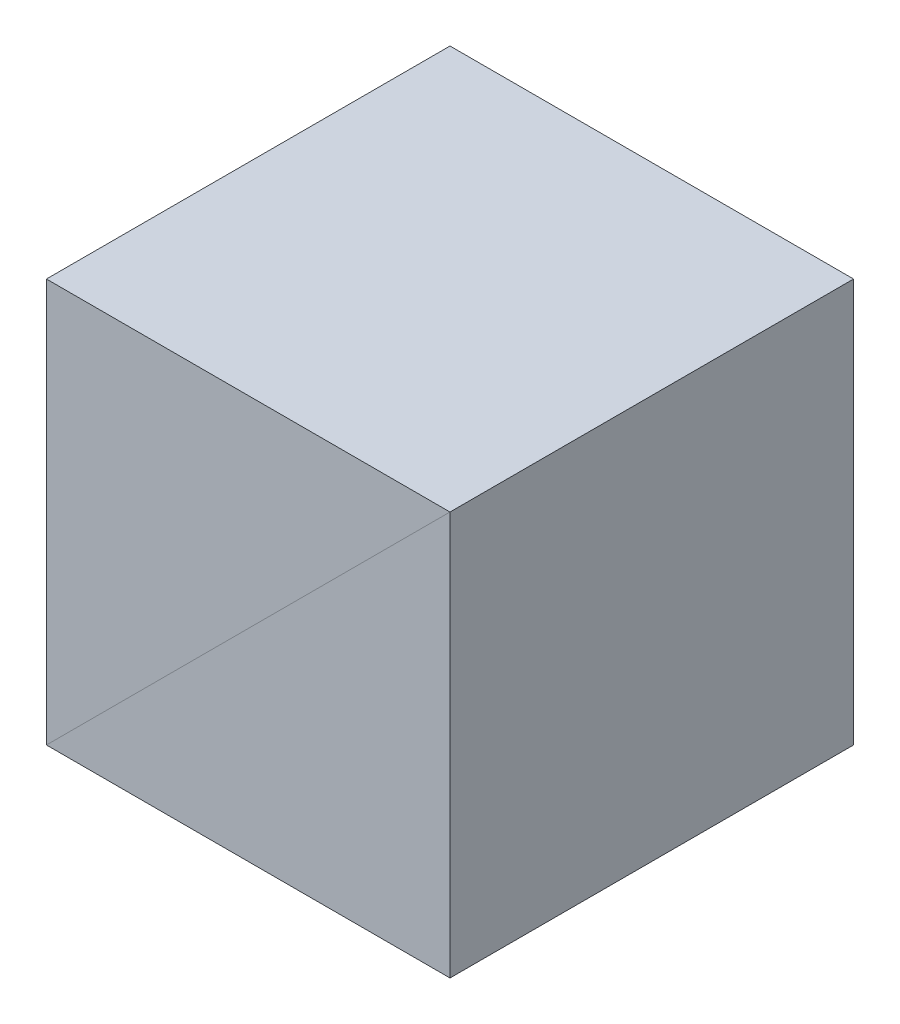
ISO-10303-21;
HEADER;
FILE_DESCRIPTION(('STEP AP214'),'2;1');
FILE_NAME('part.step','',(''),(''),'','','');
FILE_SCHEMA(('AUTOMOTIVE_DESIGN { 1 0 10303 214 1 1 1 1 }'));
ENDSEC;
DATA;
#1=APPLICATION_CONTEXT('core data for automotive mechanical design processes');
#2=APPLICATION_PROTOCOL_DEFINITION('international standard','automotive_design',2000,#1);
#3=PRODUCT_CONTEXT('',#1,'mechanical');
#4=PRODUCT('Part','Part','',(#3));
#5=PRODUCT_RELATED_PRODUCT_CATEGORY('part','',(#4));
#6=PRODUCT_DEFINITION_FORMATION('','',#4);
#7=PRODUCT_DEFINITION_CONTEXT('part definition',#1,'design');
#8=PRODUCT_DEFINITION('design','',#6,#7);
#9=PRODUCT_DEFINITION_SHAPE('','',#8);
#10=(LENGTH_UNIT() NAMED_UNIT(*) SI_UNIT(.MILLI.,.METRE.));
#11=(NAMED_UNIT(*) PLANE_ANGLE_UNIT() SI_UNIT($,.RADIAN.));
#12=(NAMED_UNIT(*) SI_UNIT($,.STERADIAN.) SOLID_ANGLE_UNIT());
#13=UNCERTAINTY_MEASURE_WITH_UNIT(LENGTH_MEASURE(1.E-05),#10,'distance_accuracy_value','');
#14=(GEOMETRIC_REPRESENTATION_CONTEXT(3) GLOBAL_UNCERTAINTY_ASSIGNED_CONTEXT((#13)) GLOBAL_UNIT_ASSIGNED_CONTEXT((#10,
#11,#12)) REPRESENTATION_CONTEXT('',''));
#15=CARTESIAN_POINT('',(0.,0.,0.));
#16=DIRECTION('',(0.,0.,1.));
#17=DIRECTION('',(1.,0.,0.));
#18=AXIS2_PLACEMENT_3D('',#15,#16,#17);
#19=CARTESIAN_POINT('',(10.,10.,10.));
#20=DIRECTION('',(-0.707106781186548,0.707106781186548,0.));
#21=DIRECTION('',(0.,0.,1.));
#22=AXIS2_PLACEMENT_3D('',#19,#20,#21);
#23=PLANE('',#22);
#24=DIRECTION('',(0.707106781186548,0.707106781186548,0.));
#25=VECTOR('',#24,1.);
#26=CARTESIAN_POINT('',(10.,10.,0.));
#27=LINE('',#26,#25);
#28=CARTESIAN_POINT('',(0.,0.,0.));
#29=VERTEX_POINT('',#28);
#30=CARTESIAN_POINT('',(10.,10.,0.));
#31=VERTEX_POINT('',#30);
#32=EDGE_CURVE('P0_E11',#29,#31,#27,.T.);
#33=ORIENTED_EDGE('',*,*,#32,.T.);
#34=DIRECTION('',(0.,0.,-1.));
#35=VECTOR('',#34,1.);
#36=CARTESIAN_POINT('',(10.,10.,10.));
#37=LINE('',#36,#35);
#38=CARTESIAN_POINT('',(10.,10.,10.));
#39=VERTEX_POINT('',#38);
#40=EDGE_CURVE('P0_E40',#39,#31,#37,.T.);
#41=ORIENTED_EDGE('',*,*,#40,.F.);
#42=DIRECTION('',(0.707106781186548,0.707106781186548,0.));
#43=VECTOR('',#42,1.);
#44=CARTESIAN_POINT('',(10.,10.,10.));
#45=LINE('',#44,#43);
#46=CARTESIAN_POINT('',(0.,0.,10.));
#47=VERTEX_POINT('',#46);
#48=EDGE_CURVE('P0_E62',#47,#39,#45,.T.);
#49=ORIENTED_EDGE('',*,*,#48,.F.);
#50=DIRECTION('',(0.,0.,-1.));
#51=VECTOR('',#50,1.);
#52=CARTESIAN_POINT('',(0.,0.,10.));
#53=LINE('',#52,#51);
#54=EDGE_CURVE('P0_E26',#47,#29,#53,.T.);
#55=ORIENTED_EDGE('',*,*,#54,.T.);
#56=EDGE_LOOP('',(#33,#41,#49,#55));
#57=FACE_BOUND('',#56,.T.);
#58=ADVANCED_FACE('P0_F16',(#57),#23,.F.);
#59=CARTESIAN_POINT('',(0.,10.,10.));
#60=DIRECTION('',(0.,-1.,0.));
#61=DIRECTION('',(0.,0.,-1.));
#62=AXIS2_PLACEMENT_3D('',#59,#60,#61);
#63=PLANE('',#62);
#64=DIRECTION('',(-1.,0.,0.));
#65=VECTOR('',#64,1.);
#66=CARTESIAN_POINT('',(0.,10.,0.));
#67=LINE('',#66,#65);
#68=CARTESIAN_POINT('',(0.,10.,0.));
#69=VERTEX_POINT('',#68);
#70=EDGE_CURVE('P0_E19',#31,#69,#67,.T.);
#71=ORIENTED_EDGE('',*,*,#70,.T.);
#72=DIRECTION('',(0.,0.,-1.));
#73=VECTOR('',#72,1.);
#74=CARTESIAN_POINT('',(0.,10.,10.));
#75=LINE('',#74,#73);
#76=CARTESIAN_POINT('',(0.,10.,10.));
#77=VERTEX_POINT('',#76);
#78=EDGE_CURVE('P0_E67',#77,#69,#75,.T.);
#79=ORIENTED_EDGE('',*,*,#78,.F.);
#80=DIRECTION('',(-1.,0.,0.));
#81=VECTOR('',#80,1.);
#82=CARTESIAN_POINT('',(0.,10.,10.));
#83=LINE('',#82,#81);
#84=EDGE_CURVE('P0_E68',#39,#77,#83,.T.);
#85=ORIENTED_EDGE('',*,*,#84,.F.);
#86=ORIENTED_EDGE('',*,*,#40,.T.);
#87=EDGE_LOOP('',(#71,#79,#85,#86));
#88=FACE_BOUND('',#87,.T.);
#89=ADVANCED_FACE('P0_F100',(#88),#63,.F.);
#90=CARTESIAN_POINT('',(0.,0.,10.));
#91=DIRECTION('',(1.,0.,0.));
#92=DIRECTION('',(0.,1.,0.));
#93=AXIS2_PLACEMENT_3D('',#90,#91,#92);
#94=PLANE('',#93);
#95=DIRECTION('',(0.,-1.,0.));
#96=VECTOR('',#95,1.);
#97=CARTESIAN_POINT('',(0.,0.,0.));
#98=LINE('',#97,#96);
#99=EDGE_CURVE('P0_E76',#69,#29,#98,.T.);
#100=ORIENTED_EDGE('',*,*,#99,.T.);
#101=ORIENTED_EDGE('',*,*,#54,.F.);
#102=DIRECTION('',(0.,-1.,0.));
#103=VECTOR('',#102,1.);
#104=CARTESIAN_POINT('',(0.,0.,10.));
#105=LINE('',#104,#103);
#106=EDGE_CURVE('P0_E74',#77,#47,#105,.T.);
#107=ORIENTED_EDGE('',*,*,#106,.F.);
#108=ORIENTED_EDGE('',*,*,#78,.T.);
#109=EDGE_LOOP('',(#100,#101,#107,#108));
#110=FACE_BOUND('',#109,.T.);
#111=ADVANCED_FACE('P0_F73',(#110),#94,.F.);
#112=CARTESIAN_POINT('',(0.,0.,10.));
#113=DIRECTION('',(0.,0.,-1.));
#114=DIRECTION('',(0.,-1.,0.));
#115=AXIS2_PLACEMENT_3D('',#112,#113,#114);
#116=PLANE('',#115);
#117=ORIENTED_EDGE('',*,*,#48,.T.);
#118=ORIENTED_EDGE('',*,*,#84,.T.);
#119=ORIENTED_EDGE('',*,*,#106,.T.);
#120=EDGE_LOOP('',(#117,#118,#119));
#121=FACE_BOUND('',#120,.T.);
#122=ADVANCED_FACE('P0_F79',(#121),#116,.F.);
#123=CARTESIAN_POINT('',(0.,0.,0.));
#124=DIRECTION('',(0.,0.,-1.));
#125=DIRECTION('',(0.,-1.,0.));
#126=AXIS2_PLACEMENT_3D('',#123,#124,#125);
#127=PLANE('',#126);
#128=ORIENTED_EDGE('',*,*,#32,.F.);
#129=ORIENTED_EDGE('',*,*,#99,.F.);
#130=ORIENTED_EDGE('',*,*,#70,.F.);
#131=EDGE_LOOP('',(#128,#129,#130));
#132=FACE_BOUND('',#131,.T.);
#133=ADVANCED_FACE('P0_F102',(#132),#127,.T.);
#134=CLOSED_SHELL('',(#58,#89,#111,#122,#133));
#135=MANIFOLD_SOLID_BREP('P0_B1',#134);
#136=CARTESIAN_POINT('',(10.,0.,10.));
#137=DIRECTION('',(0.,1.,0.));
#138=DIRECTION('',(1.,0.,0.));
#139=AXIS2_PLACEMENT_3D('',#136,#137,#138);
#140=PLANE('',#139);
#141=DIRECTION('',(1.,0.,0.));
#142=VECTOR('',#141,1.);
#143=CARTESIAN_POINT('',(10.,0.,0.));
#144=LINE('',#143,#142);
#145=CARTESIAN_POINT('',(0.,0.,0.));
#146=VERTEX_POINT('',#145);
#147=CARTESIAN_POINT('',(10.,0.,0.));
#148=VERTEX_POINT('',#147);
#149=EDGE_CURVE('P1_E11',#146,#148,#144,.T.);
#150=ORIENTED_EDGE('',*,*,#149,.T.);
#151=DIRECTION('',(0.,0.,-1.));
#152=VECTOR('',#151,1.);
#153=CARTESIAN_POINT('',(10.,0.,10.));
#154=LINE('',#153,#152);
#155=CARTESIAN_POINT('',(10.,0.,10.));
#156=VERTEX_POINT('',#155);
#157=EDGE_CURVE('P1_E42',#156,#148,#154,.T.);
#158=ORIENTED_EDGE('',*,*,#157,.F.);
#159=DIRECTION('',(1.,0.,0.));
#160=VECTOR('',#159,1.);
#161=CARTESIAN_POINT('',(10.,0.,10.));
#162=LINE('',#161,#160);
#163=CARTESIAN_POINT('',(0.,0.,10.));
#164=VERTEX_POINT('',#163);
#165=EDGE_CURVE('P1_E63',#164,#156,#162,.T.);
#166=ORIENTED_EDGE('',*,*,#165,.F.);
#167=DIRECTION('',(0.,0.,-1.));
#168=VECTOR('',#167,1.);
#169=CARTESIAN_POINT('',(0.,0.,10.));
#170=LINE('',#169,#168);
#171=EDGE_CURVE('P1_E27',#164,#146,#170,.T.);
#172=ORIENTED_EDGE('',*,*,#171,.T.);
#173=EDGE_LOOP('',(#150,#158,#166,#172));
#174=FACE_BOUND('',#173,.T.);
#175=ADVANCED_FACE('P1_F16',(#174),#140,.F.);
#176=CARTESIAN_POINT('',(10.,10.,10.));
#177=DIRECTION('',(-1.,0.,0.));
#178=DIRECTION('',(0.,0.,1.));
#179=AXIS2_PLACEMENT_3D('',#176,#177,#178);
#180=PLANE('',#179);
#181=DIRECTION('',(0.,1.,0.));
#182=VECTOR('',#181,1.);
#183=CARTESIAN_POINT('',(10.,10.,0.));
#184=LINE('',#183,#182);
#185=CARTESIAN_POINT('',(10.,10.,0.));
#186=VERTEX_POINT('',#185);
#187=EDGE_CURVE('P1_E20',#148,#186,#184,.T.);
#188=ORIENTED_EDGE('',*,*,#187,.T.);
#189=DIRECTION('',(0.,0.,-1.));
#190=VECTOR('',#189,1.);
#191=CARTESIAN_POINT('',(10.,10.,10.));
#192=LINE('',#191,#190);
#193=CARTESIAN_POINT('',(10.,10.,10.));
#194=VERTEX_POINT('',#193);
#195=EDGE_CURVE('P1_E76',#194,#186,#192,.T.);
#196=ORIENTED_EDGE('',*,*,#195,.F.);
#197=DIRECTION('',(0.,1.,0.));
#198=VECTOR('',#197,1.);
#199=CARTESIAN_POINT('',(10.,10.,10.));
#200=LINE('',#199,#198);
#201=EDGE_CURVE('P1_E90',#156,#194,#200,.T.);
#202=ORIENTED_EDGE('',*,*,#201,.F.);
#203=ORIENTED_EDGE('',*,*,#157,.T.);
#204=EDGE_LOOP('',(#188,#196,#202,#203));
#205=FACE_BOUND('',#204,.T.);
#206=ADVANCED_FACE('P1_F160',(#205),#180,.F.);
#207=CARTESIAN_POINT('',(0.,0.,10.));
#208=DIRECTION('',(0.707106781186548,-0.707106781186548,0.));
#209=DIRECTION('',(0.,0.,-1.));
#210=AXIS2_PLACEMENT_3D('',#207,#208,#209);
#211=PLANE('',#210);
#212=DIRECTION('',(-0.707106781186548,-0.707106781186548,0.));
#213=VECTOR('',#212,1.);
#214=CARTESIAN_POINT('',(0.,0.,0.));
#215=LINE('',#214,#213);
#216=EDGE_CURVE('P1_E73',#186,#146,#215,.T.);
#217=ORIENTED_EDGE('',*,*,#216,.T.);
#218=ORIENTED_EDGE('',*,*,#171,.F.);
#219=DIRECTION('',(-0.707106781186548,-0.707106781186548,0.));
#220=VECTOR('',#219,1.);
#221=CARTESIAN_POINT('',(0.,0.,10.));
#222=LINE('',#221,#220);
#223=EDGE_CURVE('P1_E87',#194,#164,#222,.T.);
#224=ORIENTED_EDGE('',*,*,#223,.F.);
#225=ORIENTED_EDGE('',*,*,#195,.T.);
#226=EDGE_LOOP('',(#217,#218,#224,#225));
#227=FACE_BOUND('',#226,.T.);
#228=ADVANCED_FACE('P1_F74',(#227),#211,.F.);
#229=CARTESIAN_POINT('',(0.,0.,10.));
#230=DIRECTION('',(0.,0.,1.));
#231=DIRECTION('',(1.,0.,0.));
#232=AXIS2_PLACEMENT_3D('',#229,#230,#231);
#233=PLANE('',#232);
#234=ORIENTED_EDGE('',*,*,#165,.T.);
#235=ORIENTED_EDGE('',*,*,#201,.T.);
#236=ORIENTED_EDGE('',*,*,#223,.T.);
#237=EDGE_LOOP('',(#234,#235,#236));
#238=FACE_BOUND('',#237,.T.);
#239=ADVANCED_FACE('P1_F18',(#238),#233,.T.);
#240=CARTESIAN_POINT('',(0.,0.,0.));
#241=DIRECTION('',(0.,0.,1.));
#242=DIRECTION('',(1.,0.,0.));
#243=AXIS2_PLACEMENT_3D('',#240,#241,#242);
#244=PLANE('',#243);
#245=ORIENTED_EDGE('',*,*,#149,.F.);
#246=ORIENTED_EDGE('',*,*,#216,.F.);
#247=ORIENTED_EDGE('',*,*,#187,.F.);
#248=EDGE_LOOP('',(#245,#246,#247));
#249=FACE_BOUND('',#248,.T.);
#250=ADVANCED_FACE('P1_F72',(#249),#244,.F.);
#251=CLOSED_SHELL('',(#175,#206,#228,#239,#250));
#252=MANIFOLD_SOLID_BREP('P1_B1',#251);
#253=ADVANCED_BREP_SHAPE_REPRESENTATION('',(#18,#135,#252),#14);
#254=SHAPE_DEFINITION_REPRESENTATION(#9,#253);
ENDSEC;
END-ISO-10303-21;
